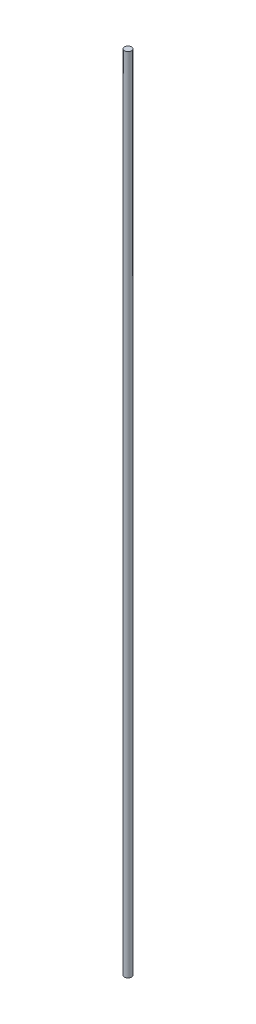
ISO-10303-21;
HEADER;
FILE_DESCRIPTION(('STEP AP214'),'2;1');
FILE_NAME('part.step','',(''),(''),'','','');
FILE_SCHEMA(('AUTOMOTIVE_DESIGN { 1 0 10303 214 1 1 1 1 }'));
ENDSEC;
DATA;
#1=APPLICATION_CONTEXT('core data for automotive mechanical design processes');
#2=APPLICATION_PROTOCOL_DEFINITION('international standard','automotive_design',2000,#1);
#3=PRODUCT_CONTEXT('',#1,'mechanical');
#4=PRODUCT('Part','Part','',(#3));
#5=PRODUCT_RELATED_PRODUCT_CATEGORY('part','',(#4));
#6=PRODUCT_DEFINITION_FORMATION('','',#4);
#7=PRODUCT_DEFINITION_CONTEXT('part definition',#1,'design');
#8=PRODUCT_DEFINITION('design','',#6,#7);
#9=PRODUCT_DEFINITION_SHAPE('','',#8);
#10=(LENGTH_UNIT() NAMED_UNIT(*) SI_UNIT(.MILLI.,.METRE.));
#11=(NAMED_UNIT(*) PLANE_ANGLE_UNIT() SI_UNIT($,.RADIAN.));
#12=(NAMED_UNIT(*) SI_UNIT($,.STERADIAN.) SOLID_ANGLE_UNIT());
#13=UNCERTAINTY_MEASURE_WITH_UNIT(LENGTH_MEASURE(1.E-05),#10,'distance_accuracy_value','');
#14=(GEOMETRIC_REPRESENTATION_CONTEXT(3) GLOBAL_UNCERTAINTY_ASSIGNED_CONTEXT((#13)) GLOBAL_UNIT_ASSIGNED_CONTEXT((#10,
#11,#12)) REPRESENTATION_CONTEXT('',''));
#15=CARTESIAN_POINT('',(0.,0.,0.));
#16=DIRECTION('',(0.,0.,1.));
#17=DIRECTION('',(1.,0.,0.));
#18=AXIS2_PLACEMENT_3D('',#15,#16,#17);
#19=CARTESIAN_POINT('',(0.,915.,0.));
#20=DIRECTION('',(0.,-1.,0.));
#21=DIRECTION('',(0.,0.,-1.));
#22=AXIS2_PLACEMENT_3D('',#19,#20,#21);
#23=CYLINDRICAL_SURFACE('',#22,4.);
#24=CARTESIAN_POINT('',(0.,915.,0.));
#25=DIRECTION('',(0.,1.,0.));
#26=DIRECTION('',(0.,0.,1.));
#27=AXIS2_PLACEMENT_3D('',#24,#25,#26);
#28=CIRCLE('',#27,4.);
#29=CARTESIAN_POINT('',(0.,915.,4.));
#30=VERTEX_POINT('',#29);
#31=EDGE_CURVE('E10',#30,#30,#28,.T.);
#32=ORIENTED_EDGE('',*,*,#31,.F.);
#33=EDGE_LOOP('',(#32));
#34=FACE_BOUND('',#33,.T.);
#35=CARTESIAN_POINT('',(0.,0.,0.));
#36=DIRECTION('',(0.,1.,0.));
#37=DIRECTION('',(0.,0.,1.));
#38=AXIS2_PLACEMENT_3D('',#35,#36,#37);
#39=CIRCLE('',#38,4.);
#40=CARTESIAN_POINT('',(0.,0.,4.));
#41=VERTEX_POINT('',#40);
#42=EDGE_CURVE('E36',#41,#41,#39,.T.);
#43=ORIENTED_EDGE('',*,*,#42,.T.);
#44=EDGE_LOOP('',(#43));
#45=FACE_BOUND('',#44,.T.);
#46=ADVANCED_FACE('F33',(#34,#45),#23,.T.);
#47=CARTESIAN_POINT('',(0.,915.,0.));
#48=DIRECTION('',(0.,1.,0.));
#49=DIRECTION('',(0.,0.,1.));
#50=AXIS2_PLACEMENT_3D('',#47,#48,#49);
#51=PLANE('',#50);
#52=ORIENTED_EDGE('',*,*,#31,.T.);
#53=EDGE_LOOP('',(#52));
#54=FACE_BOUND('',#53,.T.);
#55=ADVANCED_FACE('F48',(#54),#51,.T.);
#56=CARTESIAN_POINT('',(0.,0.,0.));
#57=DIRECTION('',(0.,1.,0.));
#58=DIRECTION('',(0.,0.,1.));
#59=AXIS2_PLACEMENT_3D('',#56,#57,#58);
#60=PLANE('',#59);
#61=ORIENTED_EDGE('',*,*,#42,.F.);
#62=EDGE_LOOP('',(#61));
#63=FACE_BOUND('',#62,.T.);
#64=ADVANCED_FACE('F46',(#63),#60,.F.);
#65=CLOSED_SHELL('',(#46,#55,#64));
#66=MANIFOLD_SOLID_BREP('B2',#65);
#67=ADVANCED_BREP_SHAPE_REPRESENTATION('',(#18,#66),#14);
#68=SHAPE_DEFINITION_REPRESENTATION(#9,#67);
ENDSEC;
END-ISO-10303-21;
